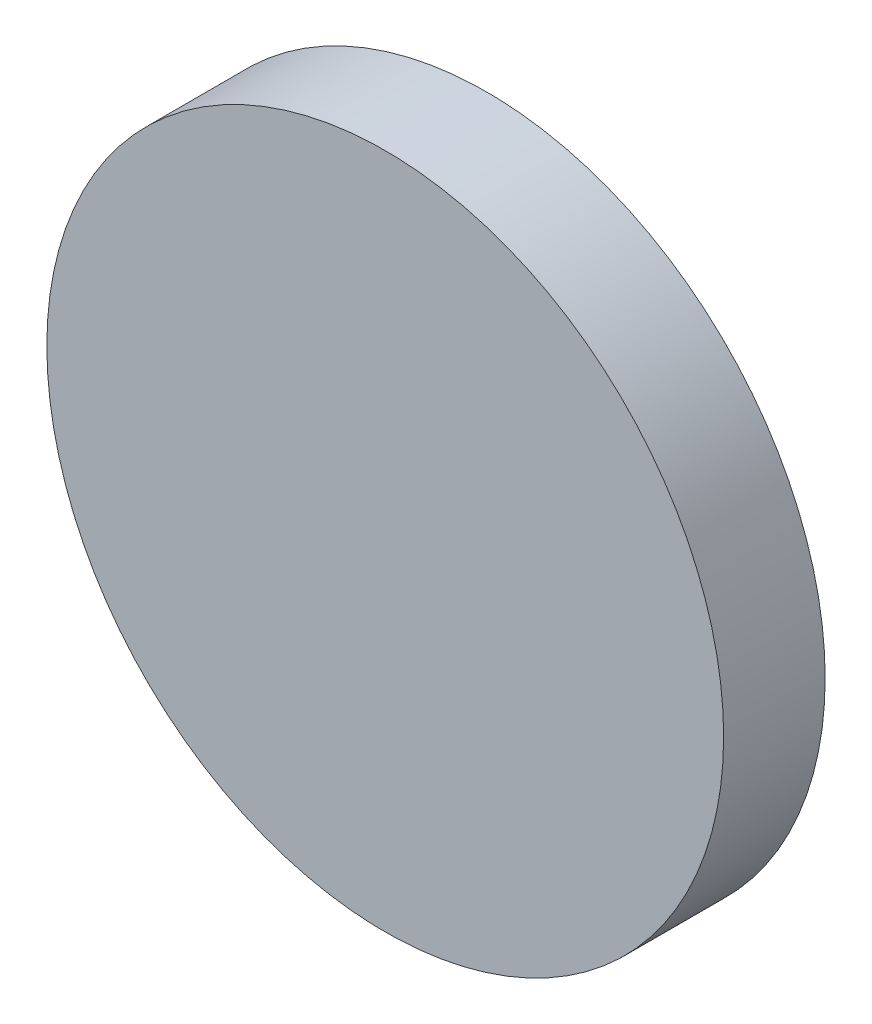
ISO-10303-21;
HEADER;
FILE_DESCRIPTION(('STEP AP214'),'2;1');
FILE_NAME('part.step','',(''),(''),'','','');
FILE_SCHEMA(('AUTOMOTIVE_DESIGN { 1 0 10303 214 1 1 1 1 }'));
ENDSEC;
DATA;
#1=APPLICATION_CONTEXT('core data for automotive mechanical design processes');
#2=APPLICATION_PROTOCOL_DEFINITION('international standard','automotive_design',2000,#1);
#3=PRODUCT_CONTEXT('',#1,'mechanical');
#4=PRODUCT('Part','Part','',(#3));
#5=PRODUCT_RELATED_PRODUCT_CATEGORY('part','',(#4));
#6=PRODUCT_DEFINITION_FORMATION('','',#4);
#7=PRODUCT_DEFINITION_CONTEXT('part definition',#1,'design');
#8=PRODUCT_DEFINITION('design','',#6,#7);
#9=PRODUCT_DEFINITION_SHAPE('','',#8);
#10=(LENGTH_UNIT() NAMED_UNIT(*) SI_UNIT(.MILLI.,.METRE.));
#11=(NAMED_UNIT(*) PLANE_ANGLE_UNIT() SI_UNIT($,.RADIAN.));
#12=(NAMED_UNIT(*) SI_UNIT($,.STERADIAN.) SOLID_ANGLE_UNIT());
#13=UNCERTAINTY_MEASURE_WITH_UNIT(LENGTH_MEASURE(1.E-05),#10,'distance_accuracy_value','');
#14=(GEOMETRIC_REPRESENTATION_CONTEXT(3) GLOBAL_UNCERTAINTY_ASSIGNED_CONTEXT((#13)) GLOBAL_UNIT_ASSIGNED_CONTEXT((#10,
#11,#12)) REPRESENTATION_CONTEXT('',''));
#15=CARTESIAN_POINT('',(0.,0.,0.));
#16=DIRECTION('',(0.,0.,1.));
#17=DIRECTION('',(1.,0.,0.));
#18=AXIS2_PLACEMENT_3D('',#15,#16,#17);
#19=CARTESIAN_POINT('',(0.,0.,3.));
#20=DIRECTION('',(0.,0.,-1.));
#21=DIRECTION('',(-1.,0.,0.));
#22=AXIS2_PLACEMENT_3D('',#19,#20,#21);
#23=CYLINDRICAL_SURFACE('',#22,10.);
#24=CARTESIAN_POINT('',(0.,0.,3.));
#25=DIRECTION('',(0.,0.,1.));
#26=DIRECTION('',(1.,0.,0.));
#27=AXIS2_PLACEMENT_3D('',#24,#25,#26);
#28=CIRCLE('',#27,10.);
#29=CARTESIAN_POINT('',(10.,0.,3.));
#30=VERTEX_POINT('',#29);
#31=EDGE_CURVE('E10',#30,#30,#28,.T.);
#32=ORIENTED_EDGE('',*,*,#31,.F.);
#33=EDGE_LOOP('',(#32));
#34=FACE_BOUND('',#33,.T.);
#35=CARTESIAN_POINT('',(0.,0.,0.));
#36=DIRECTION('',(0.,0.,1.));
#37=DIRECTION('',(1.,0.,0.));
#38=AXIS2_PLACEMENT_3D('',#35,#36,#37);
#39=CIRCLE('',#38,10.);
#40=CARTESIAN_POINT('',(10.,0.,0.));
#41=VERTEX_POINT('',#40);
#42=EDGE_CURVE('E38',#41,#41,#39,.T.);
#43=ORIENTED_EDGE('',*,*,#42,.T.);
#44=EDGE_LOOP('',(#43));
#45=FACE_BOUND('',#44,.T.);
#46=ADVANCED_FACE('F35',(#34,#45),#23,.T.);
#47=CARTESIAN_POINT('',(0.,0.,3.));
#48=DIRECTION('',(0.,0.,1.));
#49=DIRECTION('',(1.,0.,0.));
#50=AXIS2_PLACEMENT_3D('',#47,#48,#49);
#51=PLANE('',#50);
#52=ORIENTED_EDGE('',*,*,#31,.T.);
#53=EDGE_LOOP('',(#52));
#54=FACE_BOUND('',#53,.T.);
#55=ADVANCED_FACE('F50',(#54),#51,.T.);
#56=CARTESIAN_POINT('',(0.,0.,0.));
#57=DIRECTION('',(0.,0.,1.));
#58=DIRECTION('',(1.,0.,0.));
#59=AXIS2_PLACEMENT_3D('',#56,#57,#58);
#60=PLANE('',#59);
#61=ORIENTED_EDGE('',*,*,#42,.F.);
#62=EDGE_LOOP('',(#61));
#63=FACE_BOUND('',#62,.T.);
#64=ADVANCED_FACE('F48',(#63),#60,.F.);
#65=CLOSED_SHELL('',(#46,#55,#64));
#66=MANIFOLD_SOLID_BREP('B2',#65);
#67=ADVANCED_BREP_SHAPE_REPRESENTATION('',(#18,#66),#14);
#68=SHAPE_DEFINITION_REPRESENTATION(#9,#67);
ENDSEC;
END-ISO-10303-21;
